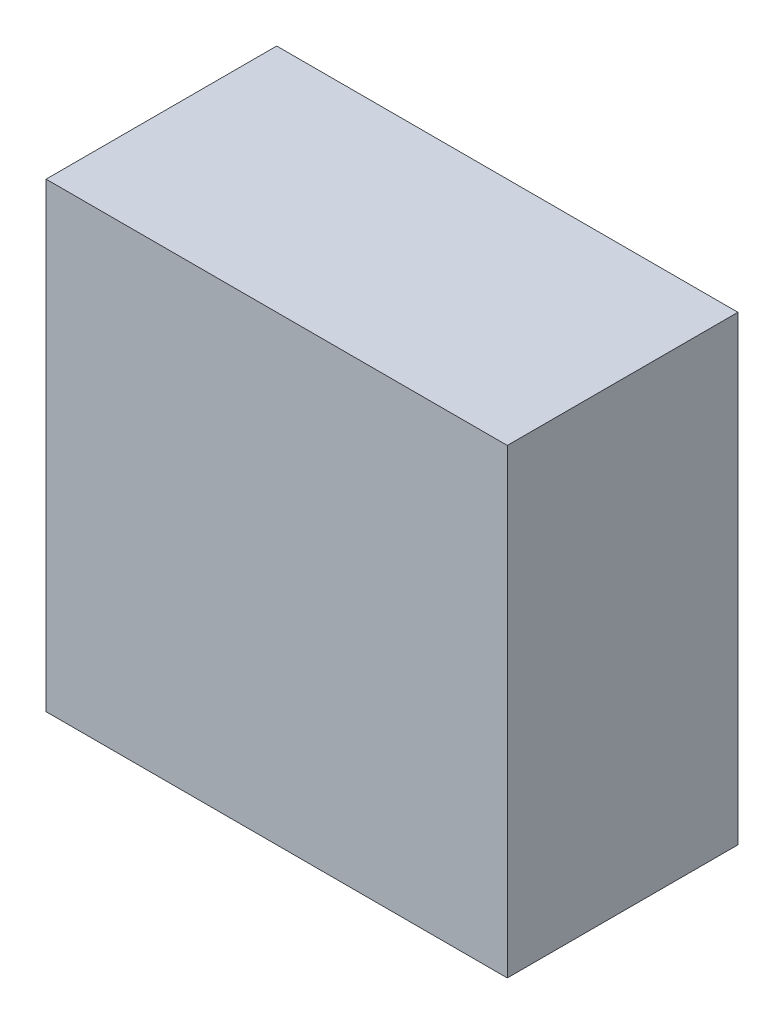
ISO-10303-21;
HEADER;
FILE_DESCRIPTION(('STEP AP214'),'2;1');
FILE_NAME('part.step','',(''),(''),'','','');
FILE_SCHEMA(('AUTOMOTIVE_DESIGN { 1 0 10303 214 1 1 1 1 }'));
ENDSEC;
DATA;
#1=APPLICATION_CONTEXT('core data for automotive mechanical design processes');
#2=APPLICATION_PROTOCOL_DEFINITION('international standard','automotive_design',2000,#1);
#3=PRODUCT_CONTEXT('',#1,'mechanical');
#4=PRODUCT('Part','Part','',(#3));
#5=PRODUCT_RELATED_PRODUCT_CATEGORY('part','',(#4));
#6=PRODUCT_DEFINITION_FORMATION('','',#4);
#7=PRODUCT_DEFINITION_CONTEXT('part definition',#1,'design');
#8=PRODUCT_DEFINITION('design','',#6,#7);
#9=PRODUCT_DEFINITION_SHAPE('','',#8);
#10=(LENGTH_UNIT() NAMED_UNIT(*) SI_UNIT(.MILLI.,.METRE.));
#11=(NAMED_UNIT(*) PLANE_ANGLE_UNIT() SI_UNIT($,.RADIAN.));
#12=(NAMED_UNIT(*) SI_UNIT($,.STERADIAN.) SOLID_ANGLE_UNIT());
#13=UNCERTAINTY_MEASURE_WITH_UNIT(LENGTH_MEASURE(1.E-05),#10,'distance_accuracy_value','');
#14=(GEOMETRIC_REPRESENTATION_CONTEXT(3) GLOBAL_UNCERTAINTY_ASSIGNED_CONTEXT((#13)) GLOBAL_UNIT_ASSIGNED_CONTEXT((#10,
#11,#12)) REPRESENTATION_CONTEXT('',''));
#15=CARTESIAN_POINT('',(0.,0.,0.));
#16=DIRECTION('',(0.,0.,1.));
#17=DIRECTION('',(1.,0.,0.));
#18=AXIS2_PLACEMENT_3D('',#15,#16,#17);
#19=CARTESIAN_POINT('',(0.,0.,2.75));
#20=DIRECTION('',(0.,0.,-1.));
#21=DIRECTION('',(-1.,0.,0.));
#22=AXIS2_PLACEMENT_3D('',#19,#20,#21);
#23=PLANE('',#22);
#24=DIRECTION('',(1.,0.,0.));
#25=VECTOR('',#24,1.);
#26=CARTESIAN_POINT('',(158.313158045852,-47.0708841556957,2.75));
#27=LINE('',#26,#25);
#28=CARTESIAN_POINT('',(158.313158045852,-47.0708841556957,2.75));
#29=VERTEX_POINT('',#28);
#30=CARTESIAN_POINT('',(154.313158045852,-47.0708841556957,2.75));
#31=VERTEX_POINT('',#30);
#32=EDGE_CURVE('E80',#29,#31,#27,.F.);
#33=ORIENTED_EDGE('',*,*,#32,.T.);
#34=DIRECTION('',(0.,1.,0.));
#35=VECTOR('',#34,1.);
#36=CARTESIAN_POINT('',(154.313158045852,-47.0708841556957,2.75));
#37=LINE('',#36,#35);
#38=CARTESIAN_POINT('',(154.313158045852,-51.0708841556957,2.75));
#39=VERTEX_POINT('',#38);
#40=EDGE_CURVE('E55',#31,#39,#37,.F.);
#41=ORIENTED_EDGE('',*,*,#40,.T.);
#42=DIRECTION('',(1.,0.,0.));
#43=VECTOR('',#42,1.);
#44=CARTESIAN_POINT('',(158.313158045852,-51.0708841556957,2.75));
#45=LINE('',#44,#43);
#46=CARTESIAN_POINT('',(158.313158045852,-51.0708841556957,2.75));
#47=VERTEX_POINT('',#46);
#48=EDGE_CURVE('E57',#39,#47,#45,.T.);
#49=ORIENTED_EDGE('',*,*,#48,.T.);
#50=DIRECTION('',(0.,1.,0.));
#51=VECTOR('',#50,1.);
#52=CARTESIAN_POINT('',(158.313158045852,-47.0708841556957,2.75));
#53=LINE('',#52,#51);
#54=EDGE_CURVE('E20',#47,#29,#53,.T.);
#55=ORIENTED_EDGE('',*,*,#54,.T.);
#56=EDGE_LOOP('',(#33,#41,#49,#55));
#57=FACE_BOUND('',#56,.T.);
#58=ADVANCED_FACE('F17',(#57),#23,.F.);
#59=CARTESIAN_POINT('',(158.313158045852,-47.0708841556957,2.75));
#60=DIRECTION('',(-1.,0.,0.));
#61=DIRECTION('',(0.,0.,1.));
#62=AXIS2_PLACEMENT_3D('',#59,#60,#61);
#63=PLANE('',#62);
#64=DIRECTION('',(0.,0.,-1.));
#65=VECTOR('',#64,1.);
#66=CARTESIAN_POINT('',(158.313158045852,-47.0708841556957,2.75));
#67=LINE('',#66,#65);
#68=CARTESIAN_POINT('',(158.313158045852,-47.0708841556957,0.75));
#69=VERTEX_POINT('',#68);
#70=EDGE_CURVE('E68',#69,#29,#67,.F.);
#71=ORIENTED_EDGE('',*,*,#70,.T.);
#72=ORIENTED_EDGE('',*,*,#54,.F.);
#73=DIRECTION('',(0.,0.,1.));
#74=VECTOR('',#73,1.);
#75=CARTESIAN_POINT('',(158.313158045852,-51.0708841556957,2.75));
#76=LINE('',#75,#74);
#77=CARTESIAN_POINT('',(158.313158045852,-51.0708841556957,0.75));
#78=VERTEX_POINT('',#77);
#79=EDGE_CURVE('E63',#47,#78,#76,.F.);
#80=ORIENTED_EDGE('',*,*,#79,.T.);
#81=DIRECTION('',(0.,1.,0.));
#82=VECTOR('',#81,1.);
#83=CARTESIAN_POINT('',(158.313158045852,0.,0.75));
#84=LINE('',#83,#82);
#85=EDGE_CURVE('E83',#69,#78,#84,.F.);
#86=ORIENTED_EDGE('',*,*,#85,.F.);
#87=EDGE_LOOP('',(#71,#72,#80,#86));
#88=FACE_BOUND('',#87,.T.);
#89=ADVANCED_FACE('F65',(#88),#63,.F.);
#90=CARTESIAN_POINT('',(158.313158045852,-51.0708841556957,2.75));
#91=DIRECTION('',(0.,1.,0.));
#92=DIRECTION('',(0.,0.,1.));
#93=AXIS2_PLACEMENT_3D('',#90,#91,#92);
#94=PLANE('',#93);
#95=ORIENTED_EDGE('',*,*,#79,.F.);
#96=ORIENTED_EDGE('',*,*,#48,.F.);
#97=DIRECTION('',(0.,0.,-1.));
#98=VECTOR('',#97,1.);
#99=CARTESIAN_POINT('',(154.313158045852,-51.0708841556957,2.75));
#100=LINE('',#99,#98);
#101=CARTESIAN_POINT('',(154.313158045852,-51.0708841556957,0.75));
#102=VERTEX_POINT('',#101);
#103=EDGE_CURVE('E75',#39,#102,#100,.T.);
#104=ORIENTED_EDGE('',*,*,#103,.T.);
#105=DIRECTION('',(-1.,0.,0.));
#106=VECTOR('',#105,1.);
#107=CARTESIAN_POINT('',(0.,-51.0708841556957,0.75));
#108=LINE('',#107,#106);
#109=EDGE_CURVE('E72',#78,#102,#108,.T.);
#110=ORIENTED_EDGE('',*,*,#109,.F.);
#111=EDGE_LOOP('',(#95,#96,#104,#110));
#112=FACE_BOUND('',#111,.T.);
#113=ADVANCED_FACE('F70',(#112),#94,.F.);
#114=CARTESIAN_POINT('',(154.313158045852,-47.0708841556957,2.75));
#115=DIRECTION('',(1.,0.,0.));
#116=DIRECTION('',(0.,0.,-1.));
#117=AXIS2_PLACEMENT_3D('',#114,#115,#116);
#118=PLANE('',#117);
#119=ORIENTED_EDGE('',*,*,#103,.F.);
#120=ORIENTED_EDGE('',*,*,#40,.F.);
#121=DIRECTION('',(0.,0.,-1.));
#122=VECTOR('',#121,1.);
#123=CARTESIAN_POINT('',(154.313158045852,-47.0708841556957,2.75));
#124=LINE('',#123,#122);
#125=CARTESIAN_POINT('',(154.313158045852,-47.0708841556957,0.75));
#126=VERTEX_POINT('',#125);
#127=EDGE_CURVE('E35',#31,#126,#124,.T.);
#128=ORIENTED_EDGE('',*,*,#127,.T.);
#129=DIRECTION('',(0.,1.,0.));
#130=VECTOR('',#129,1.);
#131=CARTESIAN_POINT('',(154.313158045852,0.,0.75));
#132=LINE('',#131,#130);
#133=EDGE_CURVE('E26',#102,#126,#132,.T.);
#134=ORIENTED_EDGE('',*,*,#133,.F.);
#135=EDGE_LOOP('',(#119,#120,#128,#134));
#136=FACE_BOUND('',#135,.T.);
#137=ADVANCED_FACE('F89',(#136),#118,.F.);
#138=CARTESIAN_POINT('',(158.313158045852,-47.0708841556957,2.75));
#139=DIRECTION('',(0.,-1.,0.));
#140=DIRECTION('',(0.,0.,-1.));
#141=AXIS2_PLACEMENT_3D('',#138,#139,#140);
#142=PLANE('',#141);
#143=ORIENTED_EDGE('',*,*,#127,.F.);
#144=ORIENTED_EDGE('',*,*,#32,.F.);
#145=ORIENTED_EDGE('',*,*,#70,.F.);
#146=DIRECTION('',(-1.,0.,0.));
#147=VECTOR('',#146,1.);
#148=CARTESIAN_POINT('',(0.,-47.0708841556957,0.75));
#149=LINE('',#148,#147);
#150=EDGE_CURVE('E11',#126,#69,#149,.F.);
#151=ORIENTED_EDGE('',*,*,#150,.F.);
#152=EDGE_LOOP('',(#143,#144,#145,#151));
#153=FACE_BOUND('',#152,.T.);
#154=ADVANCED_FACE('F91',(#153),#142,.F.);
#155=CARTESIAN_POINT('',(0.,0.,0.75));
#156=DIRECTION('',(0.,0.,-1.));
#157=DIRECTION('',(-1.,0.,0.));
#158=AXIS2_PLACEMENT_3D('',#155,#156,#157);
#159=PLANE('',#158);
#160=ORIENTED_EDGE('',*,*,#133,.T.);
#161=ORIENTED_EDGE('',*,*,#150,.T.);
#162=ORIENTED_EDGE('',*,*,#85,.T.);
#163=ORIENTED_EDGE('',*,*,#109,.T.);
#164=EDGE_LOOP('',(#160,#161,#162,#163));
#165=FACE_BOUND('',#164,.T.);
#166=ADVANCED_FACE('F88',(#165),#159,.T.);
#167=CLOSED_SHELL('',(#58,#89,#113,#137,#154,#166));
#168=MANIFOLD_SOLID_BREP('B1',#167);
#169=ADVANCED_BREP_SHAPE_REPRESENTATION('',(#18,#168),#14);
#170=SHAPE_DEFINITION_REPRESENTATION(#9,#169);
ENDSEC;
END-ISO-10303-21;
